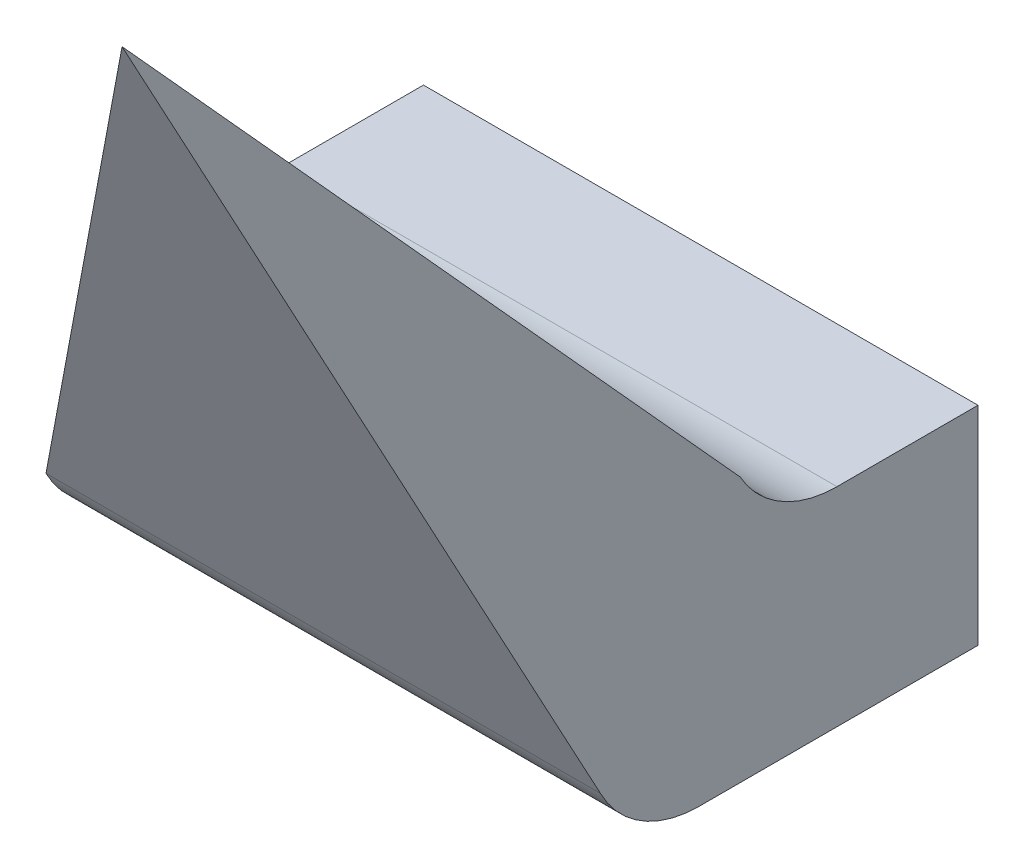
ISO-10303-21;
HEADER;
FILE_DESCRIPTION(('STEP AP214'),'2;1');
FILE_NAME('part.step','',(''),(''),'','','');
FILE_SCHEMA(('AUTOMOTIVE_DESIGN { 1 0 10303 214 1 1 1 1 }'));
ENDSEC;
DATA;
#1=APPLICATION_CONTEXT('core data for automotive mechanical design processes');
#2=APPLICATION_PROTOCOL_DEFINITION('international standard','automotive_design',2000,#1);
#3=PRODUCT_CONTEXT('',#1,'mechanical');
#4=PRODUCT('Part','Part','',(#3));
#5=PRODUCT_RELATED_PRODUCT_CATEGORY('part','',(#4));
#6=PRODUCT_DEFINITION_FORMATION('','',#4);
#7=PRODUCT_DEFINITION_CONTEXT('part definition',#1,'design');
#8=PRODUCT_DEFINITION('design','',#6,#7);
#9=PRODUCT_DEFINITION_SHAPE('','',#8);
#10=(LENGTH_UNIT() NAMED_UNIT(*) SI_UNIT(.MILLI.,.METRE.));
#11=(NAMED_UNIT(*) PLANE_ANGLE_UNIT() SI_UNIT($,.RADIAN.));
#12=(NAMED_UNIT(*) SI_UNIT($,.STERADIAN.) SOLID_ANGLE_UNIT());
#13=UNCERTAINTY_MEASURE_WITH_UNIT(LENGTH_MEASURE(1.E-05),#10,'distance_accuracy_value','');
#14=(GEOMETRIC_REPRESENTATION_CONTEXT(3) GLOBAL_UNCERTAINTY_ASSIGNED_CONTEXT((#13)) GLOBAL_UNIT_ASSIGNED_CONTEXT((#10,
#11,#12)) REPRESENTATION_CONTEXT('',''));
#15=CARTESIAN_POINT('',(0.,0.,0.));
#16=DIRECTION('',(0.,0.,1.));
#17=DIRECTION('',(1.,0.,0.));
#18=AXIS2_PLACEMENT_3D('',#15,#16,#17);
#19=CARTESIAN_POINT('',(-73.03907229268,21.89380350451,21.814122866963));
#20=DIRECTION('',(0.,0.455111059789055,-0.890434682196108));
#21=DIRECTION('',(0.,0.890434682196108,0.455111059789055));
#22=AXIS2_PLACEMENT_3D('',#19,#20,#21);
#23=PLANE('',#22);
#24=DIRECTION('',(-1.,0.,0.));
#25=VECTOR('',#24,1.);
#26=CARTESIAN_POINT('',(-73.03907229268,21.8938035045101,21.8141228669628));
#27=LINE('',#26,#25);
#28=CARTESIAN_POINT('',(-73.03907229268,21.8938035045099,21.8141228669628));
#29=VERTEX_POINT('',#28);
#30=CARTESIAN_POINT('',(-73.43907229268,21.8938035045099,21.8141228669628));
#31=VERTEX_POINT('',#30);
#32=EDGE_CURVE('E83',#29,#31,#27,.T.);
#33=ORIENTED_EDGE('',*,*,#32,.F.);
#34=DIRECTION('',(0.,-0.890434682195817,-0.455111059789624));
#35=VECTOR('',#34,1.);
#36=CARTESIAN_POINT('',(-73.03907229268,22.256621274076,21.999563060297));
#37=LINE('',#36,#35);
#38=CARTESIAN_POINT('',(-73.23907229268,22.3329201022555,21.959256338043));
#39=VERTEX_POINT('',#38);
#40=EDGE_CURVE('E47',#39,#29,#37,.T.);
#41=ORIENTED_EDGE('',*,*,#40,.F.);
#42=DIRECTION('',(0.,-0.890434682195817,-0.455111059789624));
#43=VECTOR('',#42,1.);
#44=CARTESIAN_POINT('',(-73.43907229268,22.256621274076,21.999563060297));
#45=LINE('',#44,#43);
#46=EDGE_CURVE('E97',#39,#31,#45,.T.);
#47=ORIENTED_EDGE('',*,*,#46,.T.);
#48=EDGE_LOOP('',(#33,#41,#47));
#49=FACE_BOUND('',#48,.T.);
#50=ADVANCED_FACE('F17',(#49),#23,.F.);
#51=CARTESIAN_POINT('',(-73.03907229268,21.930212389293,21.742888092387));
#52=DIRECTION('',(-1.,0.,0.));
#53=DIRECTION('',(0.,0.,1.));
#54=AXIS2_PLACEMENT_3D('',#51,#52,#53);
#55=CYLINDRICAL_SURFACE('',#54,0.08);
#56=CARTESIAN_POINT('',(-73.03907229268,21.930212389293,21.742888092387));
#57=DIRECTION('',(-1.,0.,0.));
#58=DIRECTION('',(0.,0.,1.));
#59=AXIS2_PLACEMENT_3D('',#56,#57,#58);
#60=CIRCLE('',#59,0.08);
#61=CARTESIAN_POINT('',(-73.03907229268,21.850212389293,21.742888092387));
#62=VERTEX_POINT('',#61);
#63=EDGE_CURVE('E20',#29,#62,#60,.F.);
#64=ORIENTED_EDGE('',*,*,#63,.F.);
#65=ORIENTED_EDGE('',*,*,#32,.T.);
#66=CARTESIAN_POINT('',(-73.43907229268,21.930212389293,21.742888092387));
#67=DIRECTION('',(-1.,0.,0.));
#68=DIRECTION('',(0.,0.,1.));
#69=AXIS2_PLACEMENT_3D('',#66,#67,#68);
#70=CIRCLE('',#69,0.08);
#71=CARTESIAN_POINT('',(-73.43907229268,21.850212389293,21.742888092387));
#72=VERTEX_POINT('',#71);
#73=EDGE_CURVE('E90',#31,#72,#70,.F.);
#74=ORIENTED_EDGE('',*,*,#73,.T.);
#75=DIRECTION('',(1.,0.,0.));
#76=VECTOR('',#75,1.);
#77=CARTESIAN_POINT('',(-73.03907229268,21.850212389293,21.742888092387));
#78=LINE('',#77,#76);
#79=EDGE_CURVE('E76',#72,#62,#78,.T.);
#80=ORIENTED_EDGE('',*,*,#79,.T.);
#81=EDGE_LOOP('',(#64,#65,#74,#80));
#82=FACE_BOUND('',#81,.T.);
#83=ADVANCED_FACE('F96',(#82),#55,.T.);
#84=CARTESIAN_POINT('',(-73.03907229268,21.850212389293,21.54184296363));
#85=DIRECTION('',(0.,1.,0.));
#86=DIRECTION('',(0.,0.,1.));
#87=AXIS2_PLACEMENT_3D('',#84,#85,#86);
#88=PLANE('',#87);
#89=DIRECTION('',(1.,0.,0.));
#90=VECTOR('',#89,1.);
#91=CARTESIAN_POINT('',(-73.03907229268,21.850212389293,21.54184296363));
#92=LINE('',#91,#90);
#93=CARTESIAN_POINT('',(-73.43907229268,21.850212389293,21.54184296363));
#94=VERTEX_POINT('',#93);
#95=CARTESIAN_POINT('',(-73.03907229268,21.850212389293,21.54184296363));
#96=VERTEX_POINT('',#95);
#97=EDGE_CURVE('E82',#94,#96,#92,.T.);
#98=ORIENTED_EDGE('',*,*,#97,.T.);
#99=DIRECTION('',(0.,0.,-1.));
#100=VECTOR('',#99,1.);
#101=CARTESIAN_POINT('',(-73.03907229268,21.850212389293,21.988795802143));
#102=LINE('',#101,#100);
#103=EDGE_CURVE('E57',#62,#96,#102,.T.);
#104=ORIENTED_EDGE('',*,*,#103,.F.);
#105=ORIENTED_EDGE('',*,*,#79,.F.);
#106=DIRECTION('',(0.,0.,-1.));
#107=VECTOR('',#106,1.);
#108=CARTESIAN_POINT('',(-73.43907229268,21.850212389293,21.988795802143));
#109=LINE('',#108,#107);
#110=EDGE_CURVE('E79',#72,#94,#109,.T.);
#111=ORIENTED_EDGE('',*,*,#110,.T.);
#112=EDGE_LOOP('',(#98,#104,#105,#111));
#113=FACE_BOUND('',#112,.T.);
#114=ADVANCED_FACE('F78',(#113),#88,.F.);
#115=CARTESIAN_POINT('',(-73.03907229268,22.000212389293,21.54184296363));
#116=DIRECTION('',(0.,0.,1.));
#117=DIRECTION('',(1.,0.,0.));
#118=AXIS2_PLACEMENT_3D('',#115,#116,#117);
#119=PLANE('',#118);
#120=DIRECTION('',(1.,0.,0.));
#121=VECTOR('',#120,1.);
#122=CARTESIAN_POINT('',(-73.03907229268,22.000212389293,21.54184296363));
#123=LINE('',#122,#121);
#124=CARTESIAN_POINT('',(-73.43907229268,22.000212389293,21.54184296363));
#125=VERTEX_POINT('',#124);
#126=CARTESIAN_POINT('',(-73.03907229268,22.000212389293,21.54184296363));
#127=VERTEX_POINT('',#126);
#128=EDGE_CURVE('E123',#125,#127,#123,.T.);
#129=ORIENTED_EDGE('',*,*,#128,.T.);
#130=DIRECTION('',(0.,1.,0.));
#131=VECTOR('',#130,1.);
#132=CARTESIAN_POINT('',(-73.03907229268,22.370212389293,21.54184296363));
#133=LINE('',#132,#131);
#134=EDGE_CURVE('E104',#96,#127,#133,.T.);
#135=ORIENTED_EDGE('',*,*,#134,.F.);
#136=ORIENTED_EDGE('',*,*,#97,.F.);
#137=DIRECTION('',(0.,1.,0.));
#138=VECTOR('',#137,1.);
#139=CARTESIAN_POINT('',(-73.43907229268,22.370212389293,21.54184296363));
#140=LINE('',#139,#138);
#141=EDGE_CURVE('E94',#94,#125,#140,.T.);
#142=ORIENTED_EDGE('',*,*,#141,.T.);
#143=EDGE_LOOP('',(#129,#135,#136,#142));
#144=FACE_BOUND('',#143,.T.);
#145=ADVANCED_FACE('F138',(#144),#119,.F.);
#146=CARTESIAN_POINT('',(-73.03907229268,22.000212389293,21.643581579434));
#147=DIRECTION('',(0.,-1.,0.));
#148=DIRECTION('',(0.,0.,-1.));
#149=AXIS2_PLACEMENT_3D('',#146,#147,#148);
#150=PLANE('',#149);
#151=DIRECTION('',(-1.,0.,0.));
#152=VECTOR('',#151,1.);
#153=CARTESIAN_POINT('',(-73.03907229268,22.000212389293,21.643581579434));
#154=LINE('',#153,#152);
#155=CARTESIAN_POINT('',(-73.43907229268,22.000212389293,21.643581579434));
#156=VERTEX_POINT('',#155);
#157=CARTESIAN_POINT('',(-73.03907229268,22.000212389293,21.643581579434));
#158=VERTEX_POINT('',#157);
#159=EDGE_CURVE('E119',#156,#158,#154,.F.);
#160=ORIENTED_EDGE('',*,*,#159,.T.);
#161=DIRECTION('',(0.,0.,-1.));
#162=VECTOR('',#161,1.);
#163=CARTESIAN_POINT('',(-73.03907229268,22.000212389293,21.988795802143));
#164=LINE('',#163,#162);
#165=EDGE_CURVE('E103',#127,#158,#164,.F.);
#166=ORIENTED_EDGE('',*,*,#165,.F.);
#167=ORIENTED_EDGE('',*,*,#128,.F.);
#168=DIRECTION('',(0.,0.,-1.));
#169=VECTOR('',#168,1.);
#170=CARTESIAN_POINT('',(-73.43907229268,22.000212389293,21.988795802143));
#171=LINE('',#170,#169);
#172=EDGE_CURVE('E129',#125,#156,#171,.F.);
#173=ORIENTED_EDGE('',*,*,#172,.T.);
#174=EDGE_LOOP('',(#160,#166,#167,#173));
#175=FACE_BOUND('',#174,.T.);
#176=ADVANCED_FACE('F151',(#175),#150,.F.);
#177=CARTESIAN_POINT('',(-73.03907229268,22.080212389293,21.643581579434));
#178=DIRECTION('',(-1.,0.,0.));
#179=DIRECTION('',(0.,0.,1.));
#180=AXIS2_PLACEMENT_3D('',#177,#178,#179);
#181=CYLINDRICAL_SURFACE('',#180,0.08);
#182=CARTESIAN_POINT('',(-73.03907229268,22.080212389293,21.643581579434));
#183=DIRECTION('',(-1.,0.,0.));
#184=DIRECTION('',(0.,0.,1.));
#185=AXIS2_PLACEMENT_3D('',#182,#183,#184);
#186=CIRCLE('',#185,0.08);
#187=CARTESIAN_POINT('',(-73.03907229268,22.0412058481509,21.7134277657873));
#188=VERTEX_POINT('',#187);
#189=EDGE_CURVE('E35',#158,#188,#186,.T.);
#190=ORIENTED_EDGE('',*,*,#189,.F.);
#191=ORIENTED_EDGE('',*,*,#159,.F.);
#192=CARTESIAN_POINT('',(-73.43907229268,22.080212389293,21.643581579434));
#193=DIRECTION('',(-1.,0.,0.));
#194=DIRECTION('',(0.,0.,1.));
#195=AXIS2_PLACEMENT_3D('',#192,#193,#194);
#196=CIRCLE('',#195,0.08);
#197=CARTESIAN_POINT('',(-73.43907229268,22.0412058481509,21.7134277657873));
#198=VERTEX_POINT('',#197);
#199=EDGE_CURVE('E101',#156,#198,#196,.T.);
#200=ORIENTED_EDGE('',*,*,#199,.T.);
#201=DIRECTION('',(1.,0.,0.));
#202=VECTOR('',#201,1.);
#203=CARTESIAN_POINT('',(-73.03907229268,22.0412058481508,21.7134277657873));
#204=LINE('',#203,#202);
#205=EDGE_CURVE('E161',#198,#188,#204,.T.);
#206=ORIENTED_EDGE('',*,*,#205,.T.);
#207=EDGE_LOOP('',(#190,#191,#200,#206));
#208=FACE_BOUND('',#207,.T.);
#209=ADVANCED_FACE('F142',(#208),#181,.F.);
#210=CARTESIAN_POINT('',(-73.03907229268,22.370212389293,21.988795802143));
#211=DIRECTION('',(1.,0.,0.));
#212=DIRECTION('',(0.,0.,-1.));
#213=AXIS2_PLACEMENT_3D('',#210,#211,#212);
#214=PLANE('',#213);
#215=DIRECTION('',(0.,-0.873077329419039,-0.487581764276022));
#216=VECTOR('',#215,1.);
#217=CARTESIAN_POINT('',(-73.03907229268,22.409218930435,21.918949615789));
#218=LINE('',#217,#216);
#219=EDGE_CURVE('E26',#188,#39,#218,.F.);
#220=ORIENTED_EDGE('',*,*,#219,.T.);
#221=ORIENTED_EDGE('',*,*,#40,.T.);
#222=ORIENTED_EDGE('',*,*,#63,.T.);
#223=ORIENTED_EDGE('',*,*,#103,.T.);
#224=ORIENTED_EDGE('',*,*,#134,.T.);
#225=ORIENTED_EDGE('',*,*,#165,.T.);
#226=ORIENTED_EDGE('',*,*,#189,.T.);
#227=EDGE_LOOP('',(#220,#221,#222,#223,#224,#225,#226));
#228=FACE_BOUND('',#227,.T.);
#229=ADVANCED_FACE('F140',(#228),#214,.T.);
#230=CARTESIAN_POINT('',(-73.43907229268,22.370212389293,21.988795802143));
#231=DIRECTION('',(1.,0.,0.));
#232=DIRECTION('',(0.,0.,-1.));
#233=AXIS2_PLACEMENT_3D('',#230,#231,#232);
#234=PLANE('',#233);
#235=DIRECTION('',(0.,-0.873077329419039,-0.487581764276022));
#236=VECTOR('',#235,1.);
#237=CARTESIAN_POINT('',(-73.43907229268,22.409218930435,21.918949615789));
#238=LINE('',#237,#236);
#239=EDGE_CURVE('E11',#39,#198,#238,.T.);
#240=ORIENTED_EDGE('',*,*,#239,.T.);
#241=ORIENTED_EDGE('',*,*,#199,.F.);
#242=ORIENTED_EDGE('',*,*,#172,.F.);
#243=ORIENTED_EDGE('',*,*,#141,.F.);
#244=ORIENTED_EDGE('',*,*,#110,.F.);
#245=ORIENTED_EDGE('',*,*,#73,.F.);
#246=ORIENTED_EDGE('',*,*,#46,.F.);
#247=EDGE_LOOP('',(#240,#241,#242,#243,#244,#245,#246));
#248=FACE_BOUND('',#247,.T.);
#249=ADVANCED_FACE('F88',(#248),#234,.F.);
#250=CARTESIAN_POINT('',(-73.03907229268,22.409218930435,21.918949615789));
#251=DIRECTION('',(0.,-0.487581764276022,0.873077329419039));
#252=DIRECTION('',(0.,-0.873077329419039,-0.487581764276022));
#253=AXIS2_PLACEMENT_3D('',#250,#251,#252);
#254=PLANE('',#253);
#255=ORIENTED_EDGE('',*,*,#219,.F.);
#256=ORIENTED_EDGE('',*,*,#205,.F.);
#257=ORIENTED_EDGE('',*,*,#239,.F.);
#258=EDGE_LOOP('',(#255,#256,#257));
#259=FACE_BOUND('',#258,.T.);
#260=ADVANCED_FACE('F149',(#259),#254,.F.);
#261=CLOSED_SHELL('',(#50,#83,#114,#145,#176,#209,#229,#249,#260));
#262=MANIFOLD_SOLID_BREP('B1',#261);
#263=ADVANCED_BREP_SHAPE_REPRESENTATION('',(#18,#262),#14);
#264=SHAPE_DEFINITION_REPRESENTATION(#9,#263);
ENDSEC;
END-ISO-10303-21;
